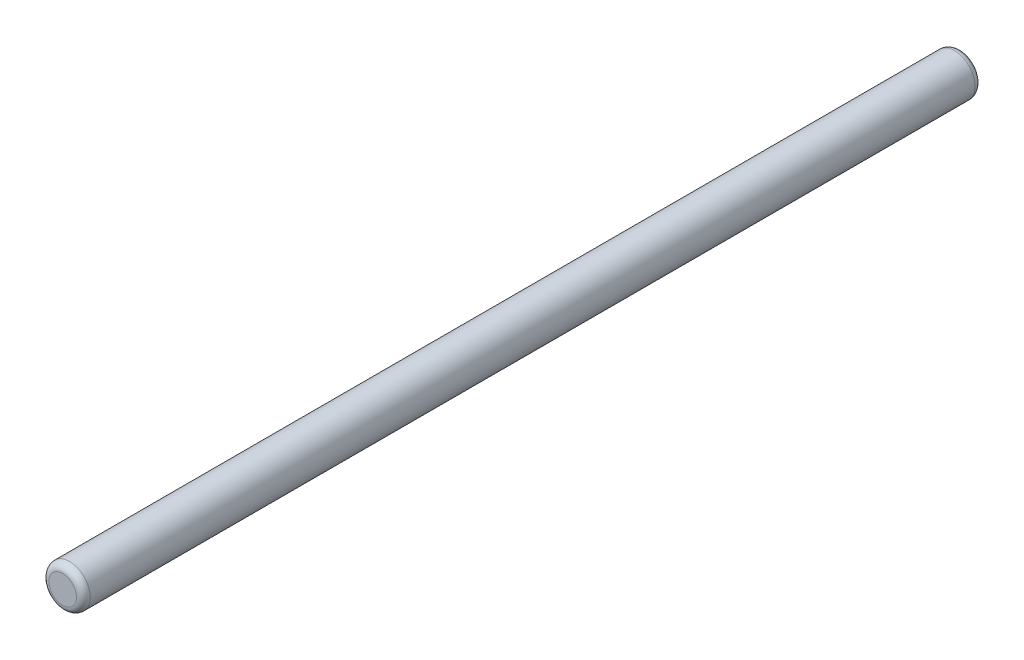
ISO-10303-21;
HEADER;
FILE_DESCRIPTION(('STEP AP214'),'2;1');
FILE_NAME('part.step','',(''),(''),'','','');
FILE_SCHEMA(('AUTOMOTIVE_DESIGN { 1 0 10303 214 1 1 1 1 }'));
ENDSEC;
DATA;
#1=APPLICATION_CONTEXT('core data for automotive mechanical design processes');
#2=APPLICATION_PROTOCOL_DEFINITION('international standard','automotive_design',2000,#1);
#3=PRODUCT_CONTEXT('',#1,'mechanical');
#4=PRODUCT('Part','Part','',(#3));
#5=PRODUCT_RELATED_PRODUCT_CATEGORY('part','',(#4));
#6=PRODUCT_DEFINITION_FORMATION('','',#4);
#7=PRODUCT_DEFINITION_CONTEXT('part definition',#1,'design');
#8=PRODUCT_DEFINITION('design','',#6,#7);
#9=PRODUCT_DEFINITION_SHAPE('','',#8);
#10=(LENGTH_UNIT() NAMED_UNIT(*) SI_UNIT(.MILLI.,.METRE.));
#11=(NAMED_UNIT(*) PLANE_ANGLE_UNIT() SI_UNIT($,.RADIAN.));
#12=(NAMED_UNIT(*) SI_UNIT($,.STERADIAN.) SOLID_ANGLE_UNIT());
#13=UNCERTAINTY_MEASURE_WITH_UNIT(LENGTH_MEASURE(1.E-05),#10,'distance_accuracy_value','');
#14=(GEOMETRIC_REPRESENTATION_CONTEXT(3) GLOBAL_UNCERTAINTY_ASSIGNED_CONTEXT((#13)) GLOBAL_UNIT_ASSIGNED_CONTEXT((#10,
#11,#12)) REPRESENTATION_CONTEXT('',''));
#15=CARTESIAN_POINT('',(0.,0.,0.));
#16=DIRECTION('',(0.,0.,1.));
#17=DIRECTION('',(1.,0.,0.));
#18=AXIS2_PLACEMENT_3D('',#15,#16,#17);
#19=CARTESIAN_POINT('',(0.,0.,65.));
#20=DIRECTION('',(0.,0.,-1.));
#21=DIRECTION('',(-1.,0.,0.));
#22=AXIS2_PLACEMENT_3D('',#19,#20,#21);
#23=CYLINDRICAL_SURFACE('',#22,1.5);
#24=CARTESIAN_POINT('',(0.,0.,0.5));
#25=DIRECTION('',(0.,0.,1.));
#26=DIRECTION('',(1.,0.,0.));
#27=AXIS2_PLACEMENT_3D('',#24,#25,#26);
#28=CIRCLE('',#27,1.5);
#29=CARTESIAN_POINT('',(1.5,0.,0.5));
#30=VERTEX_POINT('',#29);
#31=EDGE_CURVE('E42',#30,#30,#28,.T.);
#32=ORIENTED_EDGE('',*,*,#31,.T.);
#33=EDGE_LOOP('',(#32));
#34=FACE_BOUND('',#33,.T.);
#35=CARTESIAN_POINT('',(0.,0.,64.5));
#36=DIRECTION('',(0.,0.,1.));
#37=DIRECTION('',(1.,0.,0.));
#38=AXIS2_PLACEMENT_3D('',#35,#36,#37);
#39=CIRCLE('',#38,1.5);
#40=CARTESIAN_POINT('',(1.5,0.,64.5));
#41=VERTEX_POINT('',#40);
#42=EDGE_CURVE('E46',#41,#41,#39,.F.);
#43=ORIENTED_EDGE('',*,*,#42,.T.);
#44=EDGE_LOOP('',(#43));
#45=FACE_BOUND('',#44,.T.);
#46=ADVANCED_FACE('F31',(#34,#45),#23,.T.);
#47=CARTESIAN_POINT('',(0.,0.,65.));
#48=DIRECTION('',(0.,0.,1.));
#49=DIRECTION('',(1.,0.,0.));
#50=AXIS2_PLACEMENT_3D('',#47,#48,#49);
#51=PLANE('',#50);
#52=CARTESIAN_POINT('',(0.,0.,65.));
#53=DIRECTION('',(0.,0.,1.));
#54=DIRECTION('',(1.,0.,0.));
#55=AXIS2_PLACEMENT_3D('',#52,#53,#54);
#56=CIRCLE('',#55,1.);
#57=CARTESIAN_POINT('',(1.,0.,65.));
#58=VERTEX_POINT('',#57);
#59=EDGE_CURVE('E10',#58,#58,#56,.T.);
#60=ORIENTED_EDGE('',*,*,#59,.T.);
#61=EDGE_LOOP('',(#60));
#62=FACE_BOUND('',#61,.T.);
#63=ADVANCED_FACE('F62',(#62),#51,.T.);
#64=CARTESIAN_POINT('',(0.,0.,0.));
#65=DIRECTION('',(0.,0.,1.));
#66=DIRECTION('',(1.,0.,0.));
#67=AXIS2_PLACEMENT_3D('',#64,#65,#66);
#68=PLANE('',#67);
#69=CARTESIAN_POINT('',(0.,0.,0.));
#70=DIRECTION('',(0.,0.,1.));
#71=DIRECTION('',(1.,0.,0.));
#72=AXIS2_PLACEMENT_3D('',#69,#70,#71);
#73=CIRCLE('',#72,1.);
#74=CARTESIAN_POINT('',(1.,0.,0.));
#75=VERTEX_POINT('',#74);
#76=EDGE_CURVE('E38',#75,#75,#73,.F.);
#77=ORIENTED_EDGE('',*,*,#76,.T.);
#78=EDGE_LOOP('',(#77));
#79=FACE_BOUND('',#78,.T.);
#80=ADVANCED_FACE('F59',(#79),#68,.F.);
#81=CARTESIAN_POINT('',(0.,0.,0.5));
#82=DIRECTION('',(0.,0.,1.));
#83=DIRECTION('',(1.,0.,0.));
#84=AXIS2_PLACEMENT_3D('',#81,#82,#83);
#85=TOROIDAL_SURFACE('',#84,1.,0.5);
#86=ORIENTED_EDGE('',*,*,#76,.F.);
#87=EDGE_LOOP('',(#86));
#88=FACE_BOUND('',#87,.T.);
#89=ORIENTED_EDGE('',*,*,#31,.F.);
#90=EDGE_LOOP('',(#89));
#91=FACE_BOUND('',#90,.T.);
#92=ADVANCED_FACE('F55',(#88,#91),#85,.T.);
#93=CARTESIAN_POINT('',(0.,0.,64.5));
#94=DIRECTION('',(0.,0.,1.));
#95=DIRECTION('',(1.,0.,0.));
#96=AXIS2_PLACEMENT_3D('',#93,#94,#95);
#97=TOROIDAL_SURFACE('',#96,1.,0.5);
#98=ORIENTED_EDGE('',*,*,#42,.F.);
#99=EDGE_LOOP('',(#98));
#100=FACE_BOUND('',#99,.T.);
#101=ORIENTED_EDGE('',*,*,#59,.F.);
#102=EDGE_LOOP('',(#101));
#103=FACE_BOUND('',#102,.T.);
#104=ADVANCED_FACE('F33',(#100,#103),#97,.T.);
#105=CLOSED_SHELL('',(#46,#63,#80,#92,#104));
#106=MANIFOLD_SOLID_BREP('B2',#105);
#107=ADVANCED_BREP_SHAPE_REPRESENTATION('',(#18,#106),#14);
#108=SHAPE_DEFINITION_REPRESENTATION(#9,#107);
ENDSEC;
END-ISO-10303-21;
